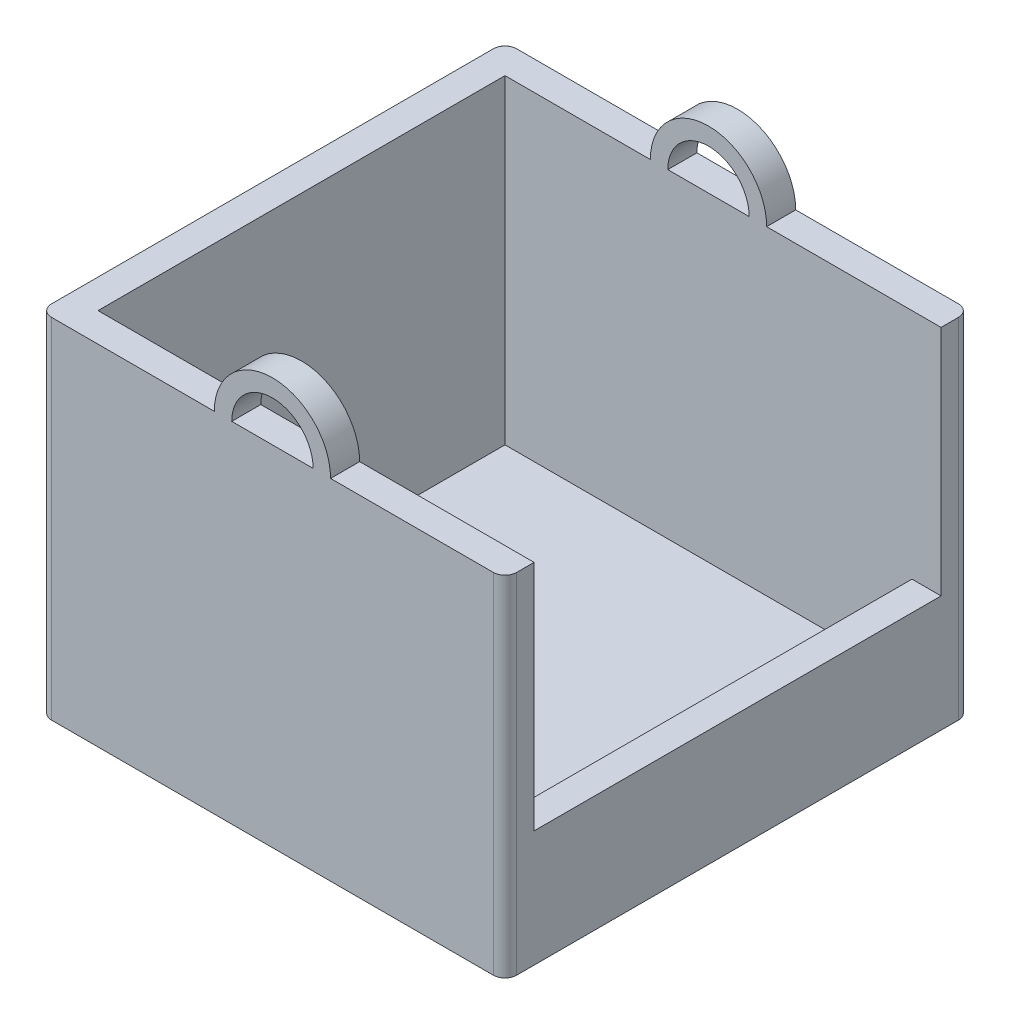
ISO-10303-21;
HEADER;
FILE_DESCRIPTION(('STEP AP214'),'2;1');
FILE_NAME('part.step','',(''),(''),'','','');
FILE_SCHEMA(('AUTOMOTIVE_DESIGN { 1 0 10303 214 1 1 1 1 }'));
ENDSEC;
DATA;
#1=APPLICATION_CONTEXT('core data for automotive mechanical design processes');
#2=APPLICATION_PROTOCOL_DEFINITION('international standard','automotive_design',2000,#1);
#3=PRODUCT_CONTEXT('',#1,'mechanical');
#4=PRODUCT('Part','Part','',(#3));
#5=PRODUCT_RELATED_PRODUCT_CATEGORY('part','',(#4));
#6=PRODUCT_DEFINITION_FORMATION('','',#4);
#7=PRODUCT_DEFINITION_CONTEXT('part definition',#1,'design');
#8=PRODUCT_DEFINITION('design','',#6,#7);
#9=PRODUCT_DEFINITION_SHAPE('','',#8);
#10=(LENGTH_UNIT() NAMED_UNIT(*) SI_UNIT(.MILLI.,.METRE.));
#11=(NAMED_UNIT(*) PLANE_ANGLE_UNIT() SI_UNIT($,.RADIAN.));
#12=(NAMED_UNIT(*) SI_UNIT($,.STERADIAN.) SOLID_ANGLE_UNIT());
#13=UNCERTAINTY_MEASURE_WITH_UNIT(LENGTH_MEASURE(1.E-05),#10,'distance_accuracy_value','');
#14=(GEOMETRIC_REPRESENTATION_CONTEXT(3) GLOBAL_UNCERTAINTY_ASSIGNED_CONTEXT((#13)) GLOBAL_UNIT_ASSIGNED_CONTEXT((#10,
#11,#12)) REPRESENTATION_CONTEXT('',''));
#15=CARTESIAN_POINT('',(0.,0.,0.));
#16=DIRECTION('',(0.,0.,1.));
#17=DIRECTION('',(1.,0.,0.));
#18=AXIS2_PLACEMENT_3D('',#15,#16,#17);
#19=CARTESIAN_POINT('',(0.,30.,0.));
#20=DIRECTION('',(0.,-1.,0.));
#21=DIRECTION('',(0.,0.,-1.));
#22=AXIS2_PLACEMENT_3D('',#19,#20,#21);
#23=PLANE('',#22);
#24=DIRECTION('',(0.,0.,-1.));
#25=VECTOR('',#24,1.);
#26=CARTESIAN_POINT('',(-4.99999999999999,30.,-17.5));
#27=LINE('',#26,#25);
#28=CARTESIAN_POINT('',(-4.99999999999999,30.,-17.5));
#29=VERTEX_POINT('',#28);
#30=CARTESIAN_POINT('',(-4.99999999999999,30.,-20.));
#31=VERTEX_POINT('',#30);
#32=EDGE_CURVE('E222',#29,#31,#27,.T.);
#33=ORIENTED_EDGE('',*,*,#32,.T.);
#34=DIRECTION('',(-1.,0.,0.));
#35=VECTOR('',#34,1.);
#36=CARTESIAN_POINT('',(-20.,30.,-20.));
#37=LINE('',#36,#35);
#38=CARTESIAN_POINT('',(-19.,30.,-20.));
#39=VERTEX_POINT('',#38);
#40=EDGE_CURVE('E197',#31,#39,#37,.T.);
#41=ORIENTED_EDGE('',*,*,#40,.T.);
#42=CARTESIAN_POINT('',(-19.,30.,-19.));
#43=DIRECTION('',(0.,-1.,0.));
#44=DIRECTION('',(0.,0.,-1.));
#45=AXIS2_PLACEMENT_3D('',#42,#43,#44);
#46=CIRCLE('',#45,1.);
#47=CARTESIAN_POINT('',(-20.,30.,-19.));
#48=VERTEX_POINT('',#47);
#49=EDGE_CURVE('E50',#39,#48,#46,.F.);
#50=ORIENTED_EDGE('',*,*,#49,.T.);
#51=DIRECTION('',(0.,0.,1.));
#52=VECTOR('',#51,1.);
#53=CARTESIAN_POINT('',(-20.,30.,20.));
#54=LINE('',#53,#52);
#55=CARTESIAN_POINT('',(-20.,30.,19.));
#56=VERTEX_POINT('',#55);
#57=EDGE_CURVE('E331',#48,#56,#54,.T.);
#58=ORIENTED_EDGE('',*,*,#57,.T.);
#59=CARTESIAN_POINT('',(-19.,30.,19.));
#60=DIRECTION('',(0.,-1.,0.));
#61=DIRECTION('',(0.,0.,-1.));
#62=AXIS2_PLACEMENT_3D('',#59,#60,#61);
#63=CIRCLE('',#62,1.);
#64=CARTESIAN_POINT('',(-19.,30.,20.));
#65=VERTEX_POINT('',#64);
#66=EDGE_CURVE('E376',#56,#65,#63,.F.);
#67=ORIENTED_EDGE('',*,*,#66,.T.);
#68=DIRECTION('',(1.,0.,0.));
#69=VECTOR('',#68,1.);
#70=CARTESIAN_POINT('',(-20.,30.,20.));
#71=LINE('',#70,#69);
#72=CARTESIAN_POINT('',(-5.,30.,20.));
#73=VERTEX_POINT('',#72);
#74=EDGE_CURVE('E335',#65,#73,#71,.T.);
#75=ORIENTED_EDGE('',*,*,#74,.T.);
#76=DIRECTION('',(0.,0.,1.));
#77=VECTOR('',#76,1.);
#78=CARTESIAN_POINT('',(-5.,30.,17.5));
#79=LINE('',#78,#77);
#80=CARTESIAN_POINT('',(-5.,30.,17.5));
#81=VERTEX_POINT('',#80);
#82=EDGE_CURVE('E247',#81,#73,#79,.T.);
#83=ORIENTED_EDGE('',*,*,#82,.F.);
#84=DIRECTION('',(1.,0.,0.));
#85=VECTOR('',#84,1.);
#86=CARTESIAN_POINT('',(-17.5,30.,17.5));
#87=LINE('',#86,#85);
#88=CARTESIAN_POINT('',(-17.5,30.,17.5));
#89=VERTEX_POINT('',#88);
#90=EDGE_CURVE('E305',#89,#81,#87,.T.);
#91=ORIENTED_EDGE('',*,*,#90,.F.);
#92=DIRECTION('',(0.,0.,1.));
#93=VECTOR('',#92,1.);
#94=CARTESIAN_POINT('',(-17.5,30.,17.5));
#95=LINE('',#94,#93);
#96=CARTESIAN_POINT('',(-17.5,30.,-17.5));
#97=VERTEX_POINT('',#96);
#98=EDGE_CURVE('E300',#97,#89,#95,.T.);
#99=ORIENTED_EDGE('',*,*,#98,.F.);
#100=DIRECTION('',(-1.,0.,0.));
#101=VECTOR('',#100,1.);
#102=CARTESIAN_POINT('',(-17.5,30.,-17.5));
#103=LINE('',#102,#101);
#104=EDGE_CURVE('E57',#29,#97,#103,.T.);
#105=ORIENTED_EDGE('',*,*,#104,.F.);
#106=EDGE_LOOP('',(#33,#41,#50,#58,#67,#75,#83,#91,#99,#105));
#107=FACE_BOUND('',#106,.T.);
#108=ADVANCED_FACE('F41',(#107),#23,.F.);
#109=DIRECTION('',(0.,0.,-1.));
#110=VECTOR('',#109,1.);
#111=CARTESIAN_POINT('',(5.,30.,-17.5));
#112=LINE('',#111,#110);
#113=CARTESIAN_POINT('',(5.,30.,-17.5));
#114=VERTEX_POINT('',#113);
#115=CARTESIAN_POINT('',(5.,30.,-20.));
#116=VERTEX_POINT('',#115);
#117=EDGE_CURVE('E207',#114,#116,#112,.T.);
#118=ORIENTED_EDGE('',*,*,#117,.F.);
#119=CARTESIAN_POINT('',(20.,30.,-17.5));
#120=VERTEX_POINT('',#119);
#121=EDGE_CURVE('E296',#120,#114,#103,.T.);
#122=ORIENTED_EDGE('',*,*,#121,.F.);
#123=DIRECTION('',(0.,0.,-1.));
#124=VECTOR('',#123,1.);
#125=CARTESIAN_POINT('',(20.,30.,20.));
#126=LINE('',#125,#124);
#127=CARTESIAN_POINT('',(20.,30.,-19.));
#128=VERTEX_POINT('',#127);
#129=EDGE_CURVE('E328',#120,#128,#126,.T.);
#130=ORIENTED_EDGE('',*,*,#129,.T.);
#131=CARTESIAN_POINT('',(19.,30.,-19.));
#132=DIRECTION('',(0.,-1.,0.));
#133=DIRECTION('',(0.,0.,-1.));
#134=AXIS2_PLACEMENT_3D('',#131,#132,#133);
#135=CIRCLE('',#134,1.);
#136=CARTESIAN_POINT('',(19.,30.,-20.));
#137=VERTEX_POINT('',#136);
#138=EDGE_CURVE('E404',#128,#137,#135,.F.);
#139=ORIENTED_EDGE('',*,*,#138,.T.);
#140=EDGE_CURVE('E196',#137,#116,#37,.T.);
#141=ORIENTED_EDGE('',*,*,#140,.T.);
#142=EDGE_LOOP('',(#118,#122,#130,#139,#141));
#143=FACE_BOUND('',#142,.T.);
#144=ADVANCED_FACE('F482',(#143),#23,.F.);
#145=DIRECTION('',(0.,0.,1.));
#146=VECTOR('',#145,1.);
#147=CARTESIAN_POINT('',(5.,30.,17.5));
#148=LINE('',#147,#146);
#149=CARTESIAN_POINT('',(5.,30.,17.5));
#150=VERTEX_POINT('',#149);
#151=CARTESIAN_POINT('',(5.,30.,20.));
#152=VERTEX_POINT('',#151);
#153=EDGE_CURVE('E252',#150,#152,#148,.T.);
#154=ORIENTED_EDGE('',*,*,#153,.T.);
#155=CARTESIAN_POINT('',(19.,30.,20.));
#156=VERTEX_POINT('',#155);
#157=EDGE_CURVE('E334',#152,#156,#71,.T.);
#158=ORIENTED_EDGE('',*,*,#157,.T.);
#159=CARTESIAN_POINT('',(19.,30.,19.));
#160=DIRECTION('',(0.,-1.,0.));
#161=DIRECTION('',(0.,0.,-1.));
#162=AXIS2_PLACEMENT_3D('',#159,#160,#161);
#163=CIRCLE('',#162,1.);
#164=CARTESIAN_POINT('',(20.,30.,19.));
#165=VERTEX_POINT('',#164);
#166=EDGE_CURVE('E379',#156,#165,#163,.F.);
#167=ORIENTED_EDGE('',*,*,#166,.T.);
#168=CARTESIAN_POINT('',(20.,30.,17.5));
#169=VERTEX_POINT('',#168);
#170=EDGE_CURVE('E325',#165,#169,#126,.T.);
#171=ORIENTED_EDGE('',*,*,#170,.T.);
#172=EDGE_CURVE('E304',#150,#169,#87,.T.);
#173=ORIENTED_EDGE('',*,*,#172,.F.);
#174=EDGE_LOOP('',(#154,#158,#167,#171,#173));
#175=FACE_BOUND('',#174,.T.);
#176=ADVANCED_FACE('F454',(#175),#23,.F.);
#177=CARTESIAN_POINT('',(3.5,30.,-20.));
#178=VERTEX_POINT('',#177);
#179=CARTESIAN_POINT('',(-3.5,30.,-20.));
#180=VERTEX_POINT('',#179);
#181=EDGE_CURVE('E190',#178,#180,#37,.T.);
#182=ORIENTED_EDGE('',*,*,#181,.T.);
#183=DIRECTION('',(0.,0.,-1.));
#184=VECTOR('',#183,1.);
#185=CARTESIAN_POINT('',(-3.49999999999999,30.,-17.5));
#186=LINE('',#185,#184);
#187=CARTESIAN_POINT('',(-3.5,30.,-17.5));
#188=VERTEX_POINT('',#187);
#189=EDGE_CURVE('E65',#188,#180,#186,.T.);
#190=ORIENTED_EDGE('',*,*,#189,.F.);
#191=CARTESIAN_POINT('',(3.5,30.,-17.5));
#192=VERTEX_POINT('',#191);
#193=EDGE_CURVE('E202',#192,#188,#103,.T.);
#194=ORIENTED_EDGE('',*,*,#193,.F.);
#195=DIRECTION('',(0.,0.,-1.));
#196=VECTOR('',#195,1.);
#197=CARTESIAN_POINT('',(3.5,30.,-17.5));
#198=LINE('',#197,#196);
#199=EDGE_CURVE('E200',#192,#178,#198,.T.);
#200=ORIENTED_EDGE('',*,*,#199,.T.);
#201=EDGE_LOOP('',(#182,#190,#194,#200));
#202=FACE_BOUND('',#201,.T.);
#203=ADVANCED_FACE('F201',(#202),#23,.F.);
#204=CARTESIAN_POINT('',(-3.5,30.,20.));
#205=VERTEX_POINT('',#204);
#206=CARTESIAN_POINT('',(3.5,30.,20.));
#207=VERTEX_POINT('',#206);
#208=EDGE_CURVE('E339',#205,#207,#71,.T.);
#209=ORIENTED_EDGE('',*,*,#208,.T.);
#210=DIRECTION('',(0.,0.,1.));
#211=VECTOR('',#210,1.);
#212=CARTESIAN_POINT('',(3.5,30.,17.5));
#213=LINE('',#212,#211);
#214=CARTESIAN_POINT('',(3.5,30.,17.5));
#215=VERTEX_POINT('',#214);
#216=EDGE_CURVE('E256',#215,#207,#213,.T.);
#217=ORIENTED_EDGE('',*,*,#216,.F.);
#218=CARTESIAN_POINT('',(-3.5,30.,17.5));
#219=VERTEX_POINT('',#218);
#220=EDGE_CURVE('E310',#219,#215,#87,.T.);
#221=ORIENTED_EDGE('',*,*,#220,.F.);
#222=DIRECTION('',(0.,0.,1.));
#223=VECTOR('',#222,1.);
#224=CARTESIAN_POINT('',(-3.5,30.,17.5));
#225=LINE('',#224,#223);
#226=EDGE_CURVE('E240',#219,#205,#225,.T.);
#227=ORIENTED_EDGE('',*,*,#226,.T.);
#228=EDGE_LOOP('',(#209,#217,#221,#227));
#229=FACE_BOUND('',#228,.T.);
#230=ADVANCED_FACE('F484',(#229),#23,.F.);
#231=CARTESIAN_POINT('',(20.,30.,20.));
#232=DIRECTION('',(-1.,0.,0.));
#233=DIRECTION('',(0.,0.,1.));
#234=AXIS2_PLACEMENT_3D('',#231,#232,#233);
#235=PLANE('',#234);
#236=DIRECTION('',(0.,0.,-1.));
#237=VECTOR('',#236,1.);
#238=CARTESIAN_POINT('',(20.,0.,20.));
#239=LINE('',#238,#237);
#240=CARTESIAN_POINT('',(20.,0.,19.));
#241=VERTEX_POINT('',#240);
#242=CARTESIAN_POINT('',(20.,0.,-19.));
#243=VERTEX_POINT('',#242);
#244=EDGE_CURVE('E324',#241,#243,#239,.T.);
#245=ORIENTED_EDGE('',*,*,#244,.T.);
#246=DIRECTION('',(0.,-1.,0.));
#247=VECTOR('',#246,1.);
#248=CARTESIAN_POINT('',(20.,30.,-19.));
#249=LINE('',#248,#247);
#250=EDGE_CURVE('E11',#243,#128,#249,.F.);
#251=ORIENTED_EDGE('',*,*,#250,.T.);
#252=ORIENTED_EDGE('',*,*,#129,.F.);
#253=DIRECTION('',(0.,1.,0.));
#254=VECTOR('',#253,1.);
#255=CARTESIAN_POINT('',(20.,0.,-17.5));
#256=LINE('',#255,#254);
#257=CARTESIAN_POINT('',(20.,10.,-17.5));
#258=VERTEX_POINT('',#257);
#259=EDGE_CURVE('E271',#258,#120,#256,.T.);
#260=ORIENTED_EDGE('',*,*,#259,.F.);
#261=DIRECTION('',(0.,0.,-1.));
#262=VECTOR('',#261,1.);
#263=CARTESIAN_POINT('',(20.,10.,0.));
#264=LINE('',#263,#262);
#265=CARTESIAN_POINT('',(20.,10.,17.5));
#266=VERTEX_POINT('',#265);
#267=EDGE_CURVE('E251',#266,#258,#264,.T.);
#268=ORIENTED_EDGE('',*,*,#267,.F.);
#269=DIRECTION('',(0.,1.,0.));
#270=VECTOR('',#269,1.);
#271=CARTESIAN_POINT('',(20.,0.,17.5));
#272=LINE('',#271,#270);
#273=EDGE_CURVE('E268',#266,#169,#272,.T.);
#274=ORIENTED_EDGE('',*,*,#273,.T.);
#275=ORIENTED_EDGE('',*,*,#170,.F.);
#276=DIRECTION('',(0.,-1.,0.));
#277=VECTOR('',#276,1.);
#278=CARTESIAN_POINT('',(20.,30.,19.));
#279=LINE('',#278,#277);
#280=EDGE_CURVE('E357',#165,#241,#279,.T.);
#281=ORIENTED_EDGE('',*,*,#280,.T.);
#282=EDGE_LOOP('',(#245,#251,#252,#260,#268,#274,#275,#281));
#283=FACE_BOUND('',#282,.T.);
#284=ADVANCED_FACE('F430',(#283),#235,.F.);
#285=CARTESIAN_POINT('',(17.5,30.,17.5));
#286=DIRECTION('',(-1.,0.,0.));
#287=DIRECTION('',(0.,0.,1.));
#288=AXIS2_PLACEMENT_3D('',#285,#286,#287);
#289=PLANE('',#288);
#290=DIRECTION('',(0.,0.,-1.));
#291=VECTOR('',#290,1.);
#292=CARTESIAN_POINT('',(17.5,10.,0.));
#293=LINE('',#292,#291);
#294=CARTESIAN_POINT('',(17.5,10.,17.5));
#295=VERTEX_POINT('',#294);
#296=CARTESIAN_POINT('',(17.5,10.,-17.5));
#297=VERTEX_POINT('',#296);
#298=EDGE_CURVE('E263',#295,#297,#293,.T.);
#299=ORIENTED_EDGE('',*,*,#298,.T.);
#300=DIRECTION('',(0.,-1.,0.));
#301=VECTOR('',#300,1.);
#302=CARTESIAN_POINT('',(17.5,30.,-17.5));
#303=LINE('',#302,#301);
#304=CARTESIAN_POINT('',(17.5,2.5,-17.5));
#305=VERTEX_POINT('',#304);
#306=EDGE_CURVE('E321',#297,#305,#303,.T.);
#307=ORIENTED_EDGE('',*,*,#306,.T.);
#308=DIRECTION('',(0.,0.,1.));
#309=VECTOR('',#308,1.);
#310=CARTESIAN_POINT('',(17.5,2.5,17.5));
#311=LINE('',#310,#309);
#312=CARTESIAN_POINT('',(17.5,2.5,17.5));
#313=VERTEX_POINT('',#312);
#314=EDGE_CURVE('E292',#305,#313,#311,.T.);
#315=ORIENTED_EDGE('',*,*,#314,.T.);
#316=DIRECTION('',(0.,-1.,0.));
#317=VECTOR('',#316,1.);
#318=CARTESIAN_POINT('',(17.5,30.,17.5));
#319=LINE('',#318,#317);
#320=EDGE_CURVE('E309',#295,#313,#319,.T.);
#321=ORIENTED_EDGE('',*,*,#320,.F.);
#322=EDGE_LOOP('',(#299,#307,#315,#321));
#323=FACE_BOUND('',#322,.T.);
#324=ADVANCED_FACE('F472',(#323),#289,.T.);
#325=CARTESIAN_POINT('',(-17.5,30.,-17.5));
#326=DIRECTION('',(0.,0.,1.));
#327=DIRECTION('',(1.,0.,0.));
#328=AXIS2_PLACEMENT_3D('',#325,#326,#327);
#329=PLANE('',#328);
#330=CARTESIAN_POINT('',(0.,30.,-17.5));
#331=DIRECTION('',(0.,0.,-1.));
#332=DIRECTION('',(-1.,0.,0.));
#333=AXIS2_PLACEMENT_3D('',#330,#331,#332);
#334=CIRCLE('',#333,5.);
#335=EDGE_CURVE('E211',#114,#29,#334,.F.);
#336=ORIENTED_EDGE('',*,*,#335,.T.);
#337=ORIENTED_EDGE('',*,*,#104,.T.);
#338=DIRECTION('',(0.,-1.,0.));
#339=VECTOR('',#338,1.);
#340=CARTESIAN_POINT('',(-17.5,30.,-17.5));
#341=LINE('',#340,#339);
#342=CARTESIAN_POINT('',(-17.5,2.5,-17.5));
#343=VERTEX_POINT('',#342);
#344=EDGE_CURVE('E317',#97,#343,#341,.T.);
#345=ORIENTED_EDGE('',*,*,#344,.T.);
#346=DIRECTION('',(1.,0.,0.));
#347=VECTOR('',#346,1.);
#348=CARTESIAN_POINT('',(-17.5,2.5,-17.5));
#349=LINE('',#348,#347);
#350=EDGE_CURVE('E288',#343,#305,#349,.T.);
#351=ORIENTED_EDGE('',*,*,#350,.T.);
#352=ORIENTED_EDGE('',*,*,#306,.F.);
#353=DIRECTION('',(1.,0.,0.));
#354=VECTOR('',#353,1.);
#355=CARTESIAN_POINT('',(17.5,10.,-17.5));
#356=LINE('',#355,#354);
#357=EDGE_CURVE('E267',#297,#258,#356,.T.);
#358=ORIENTED_EDGE('',*,*,#357,.T.);
#359=ORIENTED_EDGE('',*,*,#259,.T.);
#360=ORIENTED_EDGE('',*,*,#121,.T.);
#361=EDGE_LOOP('',(#336,#337,#345,#351,#352,#358,#359,#360));
#362=FACE_BOUND('',#361,.T.);
#363=ORIENTED_EDGE('',*,*,#193,.T.);
#364=CARTESIAN_POINT('',(0.,30.,-17.5));
#365=DIRECTION('',(0.,0.,-1.));
#366=DIRECTION('',(-1.,0.,0.));
#367=AXIS2_PLACEMENT_3D('',#364,#365,#366);
#368=CIRCLE('',#367,3.5);
#369=EDGE_CURVE('E216',#192,#188,#368,.F.);
#370=ORIENTED_EDGE('',*,*,#369,.F.);
#371=EDGE_LOOP('',(#363,#370));
#372=FACE_BOUND('',#371,.T.);
#373=ADVANCED_FACE('F463',(#362,#372),#329,.T.);
#374=CARTESIAN_POINT('',(-17.5,30.,17.5));
#375=DIRECTION('',(1.,0.,0.));
#376=DIRECTION('',(0.,0.,-1.));
#377=AXIS2_PLACEMENT_3D('',#374,#375,#376);
#378=PLANE('',#377);
#379=DIRECTION('',(0.,-1.,0.));
#380=VECTOR('',#379,1.);
#381=CARTESIAN_POINT('',(-17.5,30.,17.5));
#382=LINE('',#381,#380);
#383=CARTESIAN_POINT('',(-17.5,2.5,17.5));
#384=VERTEX_POINT('',#383);
#385=EDGE_CURVE('E313',#89,#384,#382,.T.);
#386=ORIENTED_EDGE('',*,*,#385,.T.);
#387=DIRECTION('',(0.,0.,-1.));
#388=VECTOR('',#387,1.);
#389=CARTESIAN_POINT('',(-17.5,2.5,17.5));
#390=LINE('',#389,#388);
#391=EDGE_CURVE('E281',#384,#343,#390,.T.);
#392=ORIENTED_EDGE('',*,*,#391,.T.);
#393=ORIENTED_EDGE('',*,*,#344,.F.);
#394=ORIENTED_EDGE('',*,*,#98,.T.);
#395=EDGE_LOOP('',(#386,#392,#393,#394));
#396=FACE_BOUND('',#395,.T.);
#397=ADVANCED_FACE('F461',(#396),#378,.T.);
#398=CARTESIAN_POINT('',(-17.5,30.,17.5));
#399=DIRECTION('',(0.,0.,-1.));
#400=DIRECTION('',(-1.,0.,0.));
#401=AXIS2_PLACEMENT_3D('',#398,#399,#400);
#402=PLANE('',#401);
#403=CARTESIAN_POINT('',(0.,30.,17.5));
#404=DIRECTION('',(0.,0.,1.));
#405=DIRECTION('',(1.,0.,0.));
#406=AXIS2_PLACEMENT_3D('',#403,#404,#405);
#407=CIRCLE('',#406,3.5);
#408=EDGE_CURVE('E231',#219,#215,#407,.F.);
#409=ORIENTED_EDGE('',*,*,#408,.F.);
#410=ORIENTED_EDGE('',*,*,#220,.T.);
#411=EDGE_LOOP('',(#409,#410));
#412=FACE_BOUND('',#411,.T.);
#413=ORIENTED_EDGE('',*,*,#90,.T.);
#414=CARTESIAN_POINT('',(0.,30.,17.5));
#415=DIRECTION('',(0.,0.,1.));
#416=DIRECTION('',(1.,0.,0.));
#417=AXIS2_PLACEMENT_3D('',#414,#415,#416);
#418=CIRCLE('',#417,5.);
#419=EDGE_CURVE('E235',#81,#150,#418,.F.);
#420=ORIENTED_EDGE('',*,*,#419,.T.);
#421=ORIENTED_EDGE('',*,*,#172,.T.);
#422=ORIENTED_EDGE('',*,*,#273,.F.);
#423=DIRECTION('',(1.,0.,0.));
#424=VECTOR('',#423,1.);
#425=CARTESIAN_POINT('',(17.5,10.,17.5));
#426=LINE('',#425,#424);
#427=EDGE_CURVE('E278',#295,#266,#426,.T.);
#428=ORIENTED_EDGE('',*,*,#427,.F.);
#429=ORIENTED_EDGE('',*,*,#320,.T.);
#430=DIRECTION('',(-1.,0.,0.));
#431=VECTOR('',#430,1.);
#432=CARTESIAN_POINT('',(-17.5,2.5,17.5));
#433=LINE('',#432,#431);
#434=EDGE_CURVE('E338',#313,#384,#433,.T.);
#435=ORIENTED_EDGE('',*,*,#434,.T.);
#436=ORIENTED_EDGE('',*,*,#385,.F.);
#437=EDGE_LOOP('',(#413,#420,#421,#422,#428,#429,#435,#436));
#438=FACE_BOUND('',#437,.T.);
#439=ADVANCED_FACE('F458',(#412,#438),#402,.T.);
#440=CARTESIAN_POINT('',(0.,0.,0.));
#441=DIRECTION('',(0.,-1.,0.));
#442=DIRECTION('',(0.,0.,-1.));
#443=AXIS2_PLACEMENT_3D('',#440,#441,#442);
#444=PLANE('',#443);
#445=DIRECTION('',(0.,0.,1.));
#446=VECTOR('',#445,1.);
#447=CARTESIAN_POINT('',(-20.,0.,20.));
#448=LINE('',#447,#446);
#449=CARTESIAN_POINT('',(-20.,0.,-19.));
#450=VERTEX_POINT('',#449);
#451=CARTESIAN_POINT('',(-20.,0.,19.));
#452=VERTEX_POINT('',#451);
#453=EDGE_CURVE('E347',#450,#452,#448,.T.);
#454=ORIENTED_EDGE('',*,*,#453,.F.);
#455=CARTESIAN_POINT('',(-19.,0.,-19.));
#456=DIRECTION('',(0.,-1.,0.));
#457=DIRECTION('',(0.,0.,-1.));
#458=AXIS2_PLACEMENT_3D('',#455,#456,#457);
#459=CIRCLE('',#458,1.);
#460=CARTESIAN_POINT('',(-19.,0.,-20.));
#461=VERTEX_POINT('',#460);
#462=EDGE_CURVE('E393',#450,#461,#459,.T.);
#463=ORIENTED_EDGE('',*,*,#462,.T.);
#464=DIRECTION('',(-1.,0.,0.));
#465=VECTOR('',#464,1.);
#466=CARTESIAN_POINT('',(-20.,0.,-20.));
#467=LINE('',#466,#465);
#468=CARTESIAN_POINT('',(19.,0.,-20.));
#469=VERTEX_POINT('',#468);
#470=EDGE_CURVE('E343',#469,#461,#467,.T.);
#471=ORIENTED_EDGE('',*,*,#470,.F.);
#472=CARTESIAN_POINT('',(19.,0.,-19.));
#473=DIRECTION('',(0.,-1.,0.));
#474=DIRECTION('',(0.,0.,-1.));
#475=AXIS2_PLACEMENT_3D('',#472,#473,#474);
#476=CIRCLE('',#475,1.);
#477=EDGE_CURVE('E390',#469,#243,#476,.T.);
#478=ORIENTED_EDGE('',*,*,#477,.T.);
#479=ORIENTED_EDGE('',*,*,#244,.F.);
#480=CARTESIAN_POINT('',(19.,0.,19.));
#481=DIRECTION('',(0.,-1.,0.));
#482=DIRECTION('',(0.,0.,-1.));
#483=AXIS2_PLACEMENT_3D('',#480,#481,#482);
#484=CIRCLE('',#483,1.);
#485=CARTESIAN_POINT('',(19.,0.,20.));
#486=VERTEX_POINT('',#485);
#487=EDGE_CURVE('E365',#241,#486,#484,.T.);
#488=ORIENTED_EDGE('',*,*,#487,.T.);
#489=DIRECTION('',(1.,0.,0.));
#490=VECTOR('',#489,1.);
#491=CARTESIAN_POINT('',(-20.,0.,20.));
#492=LINE('',#491,#490);
#493=CARTESIAN_POINT('',(-19.,0.,20.));
#494=VERTEX_POINT('',#493);
#495=EDGE_CURVE('E350',#494,#486,#492,.T.);
#496=ORIENTED_EDGE('',*,*,#495,.F.);
#497=CARTESIAN_POINT('',(-19.,0.,19.));
#498=DIRECTION('',(0.,-1.,0.));
#499=DIRECTION('',(0.,0.,-1.));
#500=AXIS2_PLACEMENT_3D('',#497,#498,#499);
#501=CIRCLE('',#500,1.);
#502=EDGE_CURVE('E361',#494,#452,#501,.T.);
#503=ORIENTED_EDGE('',*,*,#502,.T.);
#504=EDGE_LOOP('',(#454,#463,#471,#478,#479,#488,#496,#503));
#505=FACE_BOUND('',#504,.T.);
#506=ADVANCED_FACE('F420',(#505),#444,.T.);
#507=CARTESIAN_POINT('',(-20.,30.,-20.));
#508=DIRECTION('',(0.,0.,1.));
#509=DIRECTION('',(1.,0.,0.));
#510=AXIS2_PLACEMENT_3D('',#507,#508,#509);
#511=PLANE('',#510);
#512=ORIENTED_EDGE('',*,*,#40,.F.);
#513=CARTESIAN_POINT('',(0.,30.,-20.));
#514=DIRECTION('',(0.,0.,-1.));
#515=DIRECTION('',(-1.,0.,0.));
#516=AXIS2_PLACEMENT_3D('',#513,#514,#515);
#517=CIRCLE('',#516,5.);
#518=EDGE_CURVE('E212',#116,#31,#517,.F.);
#519=ORIENTED_EDGE('',*,*,#518,.F.);
#520=ORIENTED_EDGE('',*,*,#140,.F.);
#521=DIRECTION('',(0.,-1.,0.));
#522=VECTOR('',#521,1.);
#523=CARTESIAN_POINT('',(19.,30.,-20.));
#524=LINE('',#523,#522);
#525=EDGE_CURVE('E396',#137,#469,#524,.T.);
#526=ORIENTED_EDGE('',*,*,#525,.T.);
#527=ORIENTED_EDGE('',*,*,#470,.T.);
#528=DIRECTION('',(0.,-1.,0.));
#529=VECTOR('',#528,1.);
#530=CARTESIAN_POINT('',(-19.,30.,-20.));
#531=LINE('',#530,#529);
#532=EDGE_CURVE('E400',#461,#39,#531,.F.);
#533=ORIENTED_EDGE('',*,*,#532,.T.);
#534=EDGE_LOOP('',(#512,#519,#520,#526,#527,#533));
#535=FACE_BOUND('',#534,.T.);
#536=CARTESIAN_POINT('',(0.,30.,-20.));
#537=DIRECTION('',(0.,0.,-1.));
#538=DIRECTION('',(-1.,0.,0.));
#539=AXIS2_PLACEMENT_3D('',#536,#537,#538);
#540=CIRCLE('',#539,3.5);
#541=EDGE_CURVE('E194',#178,#180,#540,.F.);
#542=ORIENTED_EDGE('',*,*,#541,.T.);
#543=ORIENTED_EDGE('',*,*,#181,.F.);
#544=EDGE_LOOP('',(#542,#543));
#545=FACE_BOUND('',#544,.T.);
#546=ADVANCED_FACE('F192',(#535,#545),#511,.F.);
#547=CARTESIAN_POINT('',(-20.,30.,20.));
#548=DIRECTION('',(1.,0.,0.));
#549=DIRECTION('',(0.,0.,-1.));
#550=AXIS2_PLACEMENT_3D('',#547,#548,#549);
#551=PLANE('',#550);
#552=ORIENTED_EDGE('',*,*,#57,.F.);
#553=DIRECTION('',(0.,-1.,0.));
#554=VECTOR('',#553,1.);
#555=CARTESIAN_POINT('',(-20.,30.,-19.));
#556=LINE('',#555,#554);
#557=EDGE_CURVE('E386',#48,#450,#556,.T.);
#558=ORIENTED_EDGE('',*,*,#557,.T.);
#559=ORIENTED_EDGE('',*,*,#453,.T.);
#560=DIRECTION('',(0.,-1.,0.));
#561=VECTOR('',#560,1.);
#562=CARTESIAN_POINT('',(-20.,30.,19.));
#563=LINE('',#562,#561);
#564=EDGE_CURVE('E382',#452,#56,#563,.F.);
#565=ORIENTED_EDGE('',*,*,#564,.T.);
#566=EDGE_LOOP('',(#552,#558,#559,#565));
#567=FACE_BOUND('',#566,.T.);
#568=ADVANCED_FACE('F413',(#567),#551,.F.);
#569=CARTESIAN_POINT('',(-20.,30.,20.));
#570=DIRECTION('',(0.,0.,-1.));
#571=DIRECTION('',(-1.,0.,0.));
#572=AXIS2_PLACEMENT_3D('',#569,#570,#571);
#573=PLANE('',#572);
#574=ORIENTED_EDGE('',*,*,#208,.F.);
#575=CARTESIAN_POINT('',(0.,30.,20.));
#576=DIRECTION('',(0.,0.,1.));
#577=DIRECTION('',(1.,0.,0.));
#578=AXIS2_PLACEMENT_3D('',#575,#576,#577);
#579=CIRCLE('',#578,3.5);
#580=EDGE_CURVE('E225',#205,#207,#579,.F.);
#581=ORIENTED_EDGE('',*,*,#580,.T.);
#582=EDGE_LOOP('',(#574,#581));
#583=FACE_BOUND('',#582,.T.);
#584=ORIENTED_EDGE('',*,*,#495,.T.);
#585=DIRECTION('',(0.,-1.,0.));
#586=VECTOR('',#585,1.);
#587=CARTESIAN_POINT('',(19.,30.,20.));
#588=LINE('',#587,#586);
#589=EDGE_CURVE('E372',#486,#156,#588,.F.);
#590=ORIENTED_EDGE('',*,*,#589,.T.);
#591=ORIENTED_EDGE('',*,*,#157,.F.);
#592=CARTESIAN_POINT('',(0.,30.,20.));
#593=DIRECTION('',(0.,0.,1.));
#594=DIRECTION('',(1.,0.,0.));
#595=AXIS2_PLACEMENT_3D('',#592,#593,#594);
#596=CIRCLE('',#595,5.);
#597=EDGE_CURVE('E236',#73,#152,#596,.F.);
#598=ORIENTED_EDGE('',*,*,#597,.F.);
#599=ORIENTED_EDGE('',*,*,#74,.F.);
#600=DIRECTION('',(0.,-1.,0.));
#601=VECTOR('',#600,1.);
#602=CARTESIAN_POINT('',(-19.,30.,20.));
#603=LINE('',#602,#601);
#604=EDGE_CURVE('E368',#65,#494,#603,.T.);
#605=ORIENTED_EDGE('',*,*,#604,.T.);
#606=EDGE_LOOP('',(#584,#590,#591,#598,#599,#605));
#607=FACE_BOUND('',#606,.T.);
#608=ADVANCED_FACE('F441',(#583,#607),#573,.F.);
#609=CARTESIAN_POINT('',(0.,2.5,0.));
#610=DIRECTION('',(0.,-1.,0.));
#611=DIRECTION('',(0.,0.,-1.));
#612=AXIS2_PLACEMENT_3D('',#609,#610,#611);
#613=PLANE('',#612);
#614=ORIENTED_EDGE('',*,*,#314,.F.);
#615=ORIENTED_EDGE('',*,*,#350,.F.);
#616=ORIENTED_EDGE('',*,*,#391,.F.);
#617=ORIENTED_EDGE('',*,*,#434,.F.);
#618=EDGE_LOOP('',(#614,#615,#616,#617));
#619=FACE_BOUND('',#618,.T.);
#620=ADVANCED_FACE('F506',(#619),#613,.F.);
#621=CARTESIAN_POINT('',(17.5,10.,0.));
#622=DIRECTION('',(0.,-1.,0.));
#623=DIRECTION('',(0.,0.,-1.));
#624=AXIS2_PLACEMENT_3D('',#621,#622,#623);
#625=PLANE('',#624);
#626=ORIENTED_EDGE('',*,*,#267,.T.);
#627=ORIENTED_EDGE('',*,*,#357,.F.);
#628=ORIENTED_EDGE('',*,*,#298,.F.);
#629=ORIENTED_EDGE('',*,*,#427,.T.);
#630=EDGE_LOOP('',(#626,#627,#628,#629));
#631=FACE_BOUND('',#630,.T.);
#632=ADVANCED_FACE('F512',(#631),#625,.F.);
#633=CARTESIAN_POINT('',(19.,30.,19.));
#634=DIRECTION('',(0.,-1.,0.));
#635=DIRECTION('',(0.,0.,-1.));
#636=AXIS2_PLACEMENT_3D('',#633,#634,#635);
#637=CYLINDRICAL_SURFACE('',#636,1.);
#638=ORIENTED_EDGE('',*,*,#166,.F.);
#639=ORIENTED_EDGE('',*,*,#589,.F.);
#640=ORIENTED_EDGE('',*,*,#487,.F.);
#641=ORIENTED_EDGE('',*,*,#280,.F.);
#642=EDGE_LOOP('',(#638,#639,#640,#641));
#643=FACE_BOUND('',#642,.T.);
#644=ADVANCED_FACE('F437',(#643),#637,.T.);
#645=CARTESIAN_POINT('',(-19.,30.,19.));
#646=DIRECTION('',(0.,-1.,0.));
#647=DIRECTION('',(0.,0.,-1.));
#648=AXIS2_PLACEMENT_3D('',#645,#646,#647);
#649=CYLINDRICAL_SURFACE('',#648,1.);
#650=ORIENTED_EDGE('',*,*,#66,.F.);
#651=ORIENTED_EDGE('',*,*,#564,.F.);
#652=ORIENTED_EDGE('',*,*,#502,.F.);
#653=ORIENTED_EDGE('',*,*,#604,.F.);
#654=EDGE_LOOP('',(#650,#651,#652,#653));
#655=FACE_BOUND('',#654,.T.);
#656=ADVANCED_FACE('F446',(#655),#649,.T.);
#657=CARTESIAN_POINT('',(-19.,30.,-19.));
#658=DIRECTION('',(0.,-1.,0.));
#659=DIRECTION('',(0.,0.,-1.));
#660=AXIS2_PLACEMENT_3D('',#657,#658,#659);
#661=CYLINDRICAL_SURFACE('',#660,1.);
#662=ORIENTED_EDGE('',*,*,#49,.F.);
#663=ORIENTED_EDGE('',*,*,#532,.F.);
#664=ORIENTED_EDGE('',*,*,#462,.F.);
#665=ORIENTED_EDGE('',*,*,#557,.F.);
#666=EDGE_LOOP('',(#662,#663,#664,#665));
#667=FACE_BOUND('',#666,.T.);
#668=ADVANCED_FACE('F417',(#667),#661,.T.);
#669=CARTESIAN_POINT('',(19.,30.,-19.));
#670=DIRECTION('',(0.,-1.,0.));
#671=DIRECTION('',(0.,0.,-1.));
#672=AXIS2_PLACEMENT_3D('',#669,#670,#671);
#673=CYLINDRICAL_SURFACE('',#672,1.);
#674=ORIENTED_EDGE('',*,*,#138,.F.);
#675=ORIENTED_EDGE('',*,*,#250,.F.);
#676=ORIENTED_EDGE('',*,*,#477,.F.);
#677=ORIENTED_EDGE('',*,*,#525,.F.);
#678=EDGE_LOOP('',(#674,#675,#676,#677));
#679=FACE_BOUND('',#678,.T.);
#680=ADVANCED_FACE('F43',(#679),#673,.T.);
#681=CARTESIAN_POINT('',(0.,30.,17.5));
#682=DIRECTION('',(0.,0.,1.));
#683=DIRECTION('',(1.,0.,0.));
#684=AXIS2_PLACEMENT_3D('',#681,#682,#683);
#685=CYLINDRICAL_SURFACE('',#684,5.);
#686=ORIENTED_EDGE('',*,*,#597,.T.);
#687=ORIENTED_EDGE('',*,*,#153,.F.);
#688=ORIENTED_EDGE('',*,*,#419,.F.);
#689=ORIENTED_EDGE('',*,*,#82,.T.);
#690=EDGE_LOOP('',(#686,#687,#688,#689));
#691=FACE_BOUND('',#690,.T.);
#692=ADVANCED_FACE('F450',(#691),#685,.T.);
#693=CARTESIAN_POINT('',(0.,30.,17.5));
#694=DIRECTION('',(0.,0.,1.));
#695=DIRECTION('',(1.,0.,0.));
#696=AXIS2_PLACEMENT_3D('',#693,#694,#695);
#697=CYLINDRICAL_SURFACE('',#696,3.5);
#698=ORIENTED_EDGE('',*,*,#580,.F.);
#699=ORIENTED_EDGE('',*,*,#226,.F.);
#700=ORIENTED_EDGE('',*,*,#408,.T.);
#701=ORIENTED_EDGE('',*,*,#216,.T.);
#702=EDGE_LOOP('',(#698,#699,#700,#701));
#703=FACE_BOUND('',#702,.T.);
#704=ADVANCED_FACE('F503',(#703),#697,.F.);
#705=CARTESIAN_POINT('',(0.,30.,-17.5));
#706=DIRECTION('',(0.,0.,-1.));
#707=DIRECTION('',(-1.,0.,0.));
#708=AXIS2_PLACEMENT_3D('',#705,#706,#707);
#709=CYLINDRICAL_SURFACE('',#708,5.);
#710=ORIENTED_EDGE('',*,*,#518,.T.);
#711=ORIENTED_EDGE('',*,*,#32,.F.);
#712=ORIENTED_EDGE('',*,*,#335,.F.);
#713=ORIENTED_EDGE('',*,*,#117,.T.);
#714=EDGE_LOOP('',(#710,#711,#712,#713));
#715=FACE_BOUND('',#714,.T.);
#716=ADVANCED_FACE('F533',(#715),#709,.T.);
#717=CARTESIAN_POINT('',(0.,30.,-17.5));
#718=DIRECTION('',(0.,0.,-1.));
#719=DIRECTION('',(-1.,0.,0.));
#720=AXIS2_PLACEMENT_3D('',#717,#718,#719);
#721=CYLINDRICAL_SURFACE('',#720,3.5);
#722=ORIENTED_EDGE('',*,*,#541,.F.);
#723=ORIENTED_EDGE('',*,*,#199,.F.);
#724=ORIENTED_EDGE('',*,*,#369,.T.);
#725=ORIENTED_EDGE('',*,*,#189,.T.);
#726=EDGE_LOOP('',(#722,#723,#724,#725));
#727=FACE_BOUND('',#726,.T.);
#728=ADVANCED_FACE('F209',(#727),#721,.F.);
#729=CLOSED_SHELL('',(#108,#144,#176,#203,#230,#284,#324,#373,#397,#439,#506,#546,#568,#608,
#620,#632,#644,#656,#668,#680,#692,#704,#716,#728));
#730=MANIFOLD_SOLID_BREP('B2',#729);
#731=ADVANCED_BREP_SHAPE_REPRESENTATION('',(#18,#730),#14);
#732=SHAPE_DEFINITION_REPRESENTATION(#9,#731);
ENDSEC;
END-ISO-10303-21;
